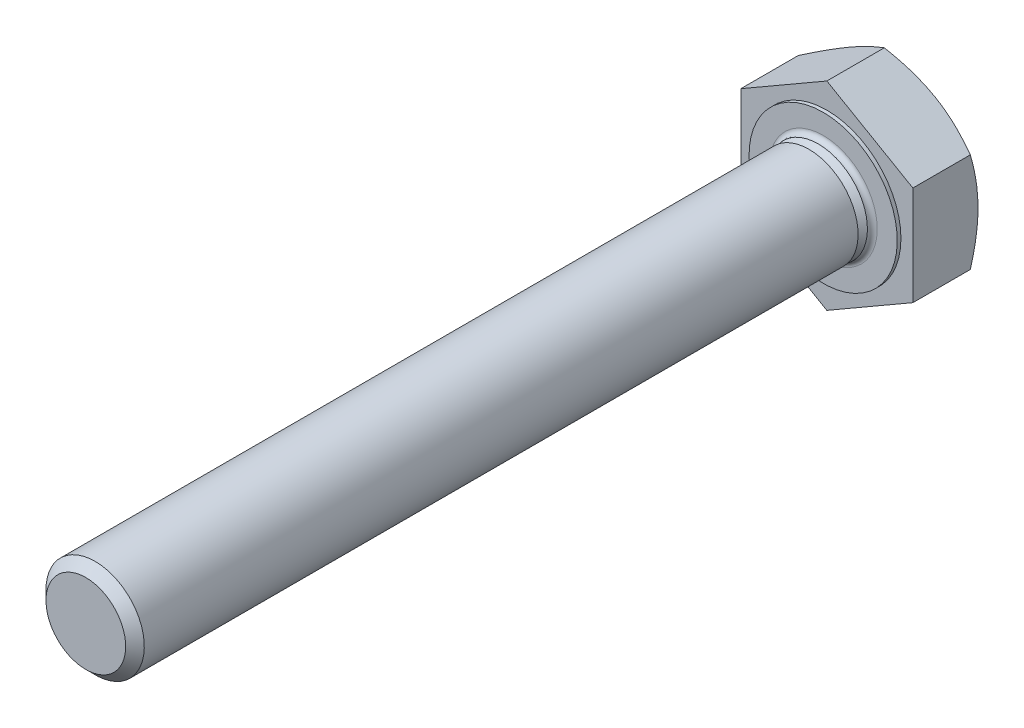
ISO-10303-21;
HEADER;
FILE_DESCRIPTION(('STEP AP214'),'2;1');
FILE_NAME('part.step','',(''),(''),'','','');
FILE_SCHEMA(('AUTOMOTIVE_DESIGN { 1 0 10303 214 1 1 1 1 }'));
ENDSEC;
DATA;
#1=APPLICATION_CONTEXT('core data for automotive mechanical design processes');
#2=APPLICATION_PROTOCOL_DEFINITION('international standard','automotive_design',2000,#1);
#3=PRODUCT_CONTEXT('',#1,'mechanical');
#4=PRODUCT('Part','Part','',(#3));
#5=PRODUCT_RELATED_PRODUCT_CATEGORY('part','',(#4));
#6=PRODUCT_DEFINITION_FORMATION('','',#4);
#7=PRODUCT_DEFINITION_CONTEXT('part definition',#1,'design');
#8=PRODUCT_DEFINITION('design','',#6,#7);
#9=PRODUCT_DEFINITION_SHAPE('','',#8);
#10=(LENGTH_UNIT() NAMED_UNIT(*) SI_UNIT(.MILLI.,.METRE.));
#11=(NAMED_UNIT(*) PLANE_ANGLE_UNIT() SI_UNIT($,.RADIAN.));
#12=(NAMED_UNIT(*) SI_UNIT($,.STERADIAN.) SOLID_ANGLE_UNIT());
#13=UNCERTAINTY_MEASURE_WITH_UNIT(LENGTH_MEASURE(1.E-05),#10,'distance_accuracy_value','');
#14=(GEOMETRIC_REPRESENTATION_CONTEXT(3) GLOBAL_UNCERTAINTY_ASSIGNED_CONTEXT((#13)) GLOBAL_UNIT_ASSIGNED_CONTEXT((#10,
#11,#12)) REPRESENTATION_CONTEXT('',''));
#15=CARTESIAN_POINT('',(0.,0.,0.));
#16=DIRECTION('',(0.,0.,1.));
#17=DIRECTION('',(1.,0.,0.));
#18=AXIS2_PLACEMENT_3D('',#15,#16,#17);
#19=CARTESIAN_POINT('',(0.,0.8105625,30.));
#20=DIRECTION('',(0.,0.,1.));
#21=DIRECTION('',(0.,1.,0.));
#22=AXIS2_PLACEMENT_3D('',#19,#20,#21);
#23=PLANE('',#22);
#24=CARTESIAN_POINT('',(0.,0.,30.));
#25=DIRECTION('',(0.,0.,1.));
#26=DIRECTION('',(0.,1.,0.));
#27=AXIS2_PLACEMENT_3D('',#24,#25,#26);
#28=CIRCLE('',#27,1.621125);
#29=CARTESIAN_POINT('',(0.,1.621125,30.));
#30=VERTEX_POINT('',#29);
#31=EDGE_CURVE('E11',#30,#30,#28,.T.);
#32=ORIENTED_EDGE('',*,*,#31,.T.);
#33=EDGE_LOOP('',(#32));
#34=FACE_BOUND('',#33,.T.);
#35=ADVANCED_FACE('F17',(#34),#23,.T.);
#36=CARTESIAN_POINT('',(0.,0.,29.8105625));
#37=DIRECTION('',(0.,0.,-1.));
#38=DIRECTION('',(0.,1.,0.));
#39=AXIS2_PLACEMENT_3D('',#36,#37,#38);
#40=CONICAL_SURFACE('',#39,1.8105625,0.785398163397448);
#41=CARTESIAN_POINT('',(0.,0.,29.621125));
#42=DIRECTION('',(0.,0.,1.));
#43=DIRECTION('',(0.,1.,0.));
#44=AXIS2_PLACEMENT_3D('',#41,#42,#43);
#45=CIRCLE('',#44,2.);
#46=CARTESIAN_POINT('',(0.,2.,29.621125));
#47=VERTEX_POINT('',#46);
#48=EDGE_CURVE('E26',#47,#47,#45,.T.);
#49=ORIENTED_EDGE('',*,*,#48,.T.);
#50=EDGE_LOOP('',(#49));
#51=FACE_BOUND('',#50,.T.);
#52=ORIENTED_EDGE('',*,*,#31,.F.);
#53=EDGE_LOOP('',(#52));
#54=FACE_BOUND('',#53,.T.);
#55=ADVANCED_FACE('F319',(#51,#54),#40,.T.);
#56=CARTESIAN_POINT('',(0.,0.,15.1));
#57=DIRECTION('',(0.,0.,-1.));
#58=DIRECTION('',(0.,1.,0.));
#59=AXIS2_PLACEMENT_3D('',#56,#57,#58);
#60=CYLINDRICAL_SURFACE('',#59,2.);
#61=CARTESIAN_POINT('',(0.,0.,0.578875));
#62=DIRECTION('',(0.,0.,1.));
#63=DIRECTION('',(0.,1.,0.));
#64=AXIS2_PLACEMENT_3D('',#61,#62,#63);
#65=CIRCLE('',#64,2.);
#66=CARTESIAN_POINT('',(0.,2.,0.578875));
#67=VERTEX_POINT('',#66);
#68=EDGE_CURVE('E165',#67,#67,#65,.T.);
#69=ORIENTED_EDGE('',*,*,#68,.T.);
#70=EDGE_LOOP('',(#69));
#71=FACE_BOUND('',#70,.T.);
#72=ORIENTED_EDGE('',*,*,#48,.F.);
#73=EDGE_LOOP('',(#72));
#74=FACE_BOUND('',#73,.T.);
#75=ADVANCED_FACE('F323',(#71,#74),#60,.T.);
#76=CARTESIAN_POINT('',(0.,1.8105625,0.578875));
#77=DIRECTION('',(0.,0.,-1.));
#78=DIRECTION('',(0.,-1.,0.));
#79=AXIS2_PLACEMENT_3D('',#76,#77,#78);
#80=PLANE('',#79);
#81=CARTESIAN_POINT('',(0.,0.,0.578875));
#82=DIRECTION('',(0.,0.,1.));
#83=DIRECTION('',(0.,1.,0.));
#84=AXIS2_PLACEMENT_3D('',#81,#82,#83);
#85=CIRCLE('',#84,1.621125);
#86=CARTESIAN_POINT('',(0.,1.621125,0.578875));
#87=VERTEX_POINT('',#86);
#88=EDGE_CURVE('E161',#87,#87,#85,.T.);
#89=ORIENTED_EDGE('',*,*,#88,.T.);
#90=EDGE_LOOP('',(#89));
#91=FACE_BOUND('',#90,.T.);
#92=ORIENTED_EDGE('',*,*,#68,.F.);
#93=EDGE_LOOP('',(#92));
#94=FACE_BOUND('',#93,.T.);
#95=ADVANCED_FACE('F329',(#91,#94),#80,.T.);
#96=CARTESIAN_POINT('',(0.,0.,0.3894375));
#97=DIRECTION('',(0.,0.,-1.));
#98=DIRECTION('',(0.,1.,0.));
#99=AXIS2_PLACEMENT_3D('',#96,#97,#98);
#100=CONICAL_SURFACE('',#99,1.8105625,0.785398163397448);
#101=CARTESIAN_POINT('',(0.,0.,0.2));
#102=DIRECTION('',(0.,0.,1.));
#103=DIRECTION('',(0.,1.,0.));
#104=AXIS2_PLACEMENT_3D('',#101,#102,#103);
#105=CIRCLE('',#104,2.);
#106=CARTESIAN_POINT('',(0.,2.,0.2));
#107=VERTEX_POINT('',#106);
#108=EDGE_CURVE('E166',#107,#107,#105,.T.);
#109=ORIENTED_EDGE('',*,*,#108,.T.);
#110=EDGE_LOOP('',(#109));
#111=FACE_BOUND('',#110,.T.);
#112=ORIENTED_EDGE('',*,*,#88,.F.);
#113=EDGE_LOOP('',(#112));
#114=FACE_BOUND('',#113,.T.);
#115=ADVANCED_FACE('F336',(#111,#114),#100,.T.);
#116=CARTESIAN_POINT('',(0.,0.,0.2));
#117=DIRECTION('',(0.,0.,1.));
#118=DIRECTION('',(1.,0.,0.));
#119=AXIS2_PLACEMENT_3D('',#116,#117,#118);
#120=TOROIDAL_SURFACE('',#119,2.2,0.2);
#121=CARTESIAN_POINT('',(0.,0.,0.));
#122=DIRECTION('',(0.,0.,1.));
#123=DIRECTION('',(0.,1.,0.));
#124=AXIS2_PLACEMENT_3D('',#121,#122,#123);
#125=CIRCLE('',#124,2.2);
#126=CARTESIAN_POINT('',(0.,2.2,0.));
#127=VERTEX_POINT('',#126);
#128=EDGE_CURVE('E199',#127,#127,#125,.T.);
#129=ORIENTED_EDGE('',*,*,#128,.T.);
#130=EDGE_LOOP('',(#129));
#131=FACE_BOUND('',#130,.T.);
#132=ORIENTED_EDGE('',*,*,#108,.F.);
#133=EDGE_LOOP('',(#132));
#134=FACE_BOUND('',#133,.T.);
#135=ADVANCED_FACE('F333',(#131,#134),#120,.F.);
#136=CARTESIAN_POINT('',(0.,2.6075,0.));
#137=DIRECTION('',(0.,0.,1.));
#138=DIRECTION('',(0.,1.,0.));
#139=AXIS2_PLACEMENT_3D('',#136,#137,#138);
#140=PLANE('',#139);
#141=CARTESIAN_POINT('',(0.,0.,0.));
#142=DIRECTION('',(0.,0.,1.));
#143=DIRECTION('',(0.,1.,0.));
#144=AXIS2_PLACEMENT_3D('',#141,#142,#143);
#145=CIRCLE('',#144,3.015);
#146=CARTESIAN_POINT('',(0.,3.015,0.));
#147=VERTEX_POINT('',#146);
#148=EDGE_CURVE('E198',#147,#147,#145,.T.);
#149=ORIENTED_EDGE('',*,*,#148,.T.);
#150=EDGE_LOOP('',(#149));
#151=FACE_BOUND('',#150,.T.);
#152=ORIENTED_EDGE('',*,*,#128,.F.);
#153=EDGE_LOOP('',(#152));
#154=FACE_BOUND('',#153,.T.);
#155=ADVANCED_FACE('F335',(#151,#154),#140,.T.);
#156=CARTESIAN_POINT('',(0.,0.,-0.325));
#157=DIRECTION('',(0.,0.,-1.));
#158=DIRECTION('',(0.,1.,0.));
#159=AXIS2_PLACEMENT_3D('',#156,#157,#158);
#160=CYLINDRICAL_SURFACE('',#159,3.015);
#161=ORIENTED_EDGE('',*,*,#148,.F.);
#162=EDGE_LOOP('',(#161));
#163=FACE_BOUND('',#162,.T.);
#164=CARTESIAN_POINT('',(0.,0.,-0.15));
#165=DIRECTION('',(0.,0.,1.));
#166=DIRECTION('',(0.,1.,0.));
#167=AXIS2_PLACEMENT_3D('',#164,#165,#166);
#168=CIRCLE('',#167,3.015);
#169=CARTESIAN_POINT('',(0.,-3.015,-0.15));
#170=VERTEX_POINT('',#169);
#171=EDGE_CURVE('E182',#170,#170,#168,.T.);
#172=ORIENTED_EDGE('',*,*,#171,.T.);
#173=EDGE_LOOP('',(#172));
#174=FACE_BOUND('',#173,.T.);
#175=ADVANCED_FACE('F338',(#163,#174),#160,.T.);
#176=CARTESIAN_POINT('',(-1.75,-3.03108891324554,0.85));
#177=DIRECTION('',(-0.5,-0.866025403784439,0.));
#178=DIRECTION('',(-0.866025403784439,0.5,0.));
#179=AXIS2_PLACEMENT_3D('',#176,#177,#178);
#180=PLANE('',#179);
#181=CARTESIAN_POINT('',(0.00181468412044161,-4.04249959269281,-2.48678747896463));
#182=CARTESIAN_POINT('',(-0.937092954004441,-3.50042101507722,-2.8));
#183=CARTESIAN_POINT('',(-1.75,-3.03108891324554,-2.8));
#184=CARTESIAN_POINT('',(-2.56290704599556,-2.56175681141386,-2.8));
#185=CARTESIAN_POINT('',(-3.50181468412044,-2.01967823379826,-2.48678747896463));
#186=(BOUNDED_CURVE() B_SPLINE_CURVE(2,(#181,#182,#183,#184,#185),.UNSPECIFIED.,.F.,
.F.) B_SPLINE_CURVE_WITH_KNOTS((3,2,3),(0.,2.05216073912997,4.10432147825994),
.UNSPECIFIED.) CURVE() GEOMETRIC_REPRESENTATION_ITEM() RATIONAL_B_SPLINE_CURVE((1.,
1.03802697460134,1.,1.03802697460134,1.)) REPRESENTATION_ITEM(''));
#187=CARTESIAN_POINT('',(0.,-4.04145188432738,-2.48739260883036));
#188=VERTEX_POINT('',#187);
#189=CARTESIAN_POINT('',(-1.75,-3.03108891324554,-2.8));
#190=VERTEX_POINT('',#189);
#191=EDGE_CURVE('E122',#188,#190,#186,.T.);
#192=ORIENTED_EDGE('',*,*,#191,.F.);
#193=DIRECTION('',(0.,0.,-1.));
#194=VECTOR('',#193,1.);
#195=CARTESIAN_POINT('',(0.,-4.04145188432738,0.85));
#196=LINE('',#195,#194);
#197=CARTESIAN_POINT('',(0.,-4.04145188432738,-0.15));
#198=VERTEX_POINT('',#197);
#199=EDGE_CURVE('E200',#198,#188,#196,.T.);
#200=ORIENTED_EDGE('',*,*,#199,.F.);
#201=DIRECTION('',(0.866025403784439,-0.5,0.));
#202=VECTOR('',#201,1.);
#203=CARTESIAN_POINT('',(-1.31238653815018,-3.28374516324554,-0.15));
#204=LINE('',#203,#202);
#205=CARTESIAN_POINT('',(-3.5,-2.02072594216369,-0.15));
#206=VERTEX_POINT('',#205);
#207=EDGE_CURVE('E220',#206,#198,#204,.T.);
#208=ORIENTED_EDGE('',*,*,#207,.F.);
#209=DIRECTION('',(0.,0.,-1.));
#210=VECTOR('',#209,1.);
#211=CARTESIAN_POINT('',(-3.5,-2.02072594216369,0.85));
#212=LINE('',#211,#210);
#213=CARTESIAN_POINT('',(-3.5,-2.02072594216369,-2.48739260883036));
#214=VERTEX_POINT('',#213);
#215=EDGE_CURVE('E125',#206,#214,#212,.T.);
#216=ORIENTED_EDGE('',*,*,#215,.T.);
#217=CARTESIAN_POINT('',(0.00181468412044161,-4.04249959269281,-2.48678747896463));
#218=CARTESIAN_POINT('',(-0.937092954004441,-3.50042101507722,-2.8));
#219=CARTESIAN_POINT('',(-1.75,-3.03108891324554,-2.8));
#220=CARTESIAN_POINT('',(-2.56290704599556,-2.56175681141386,-2.8));
#221=CARTESIAN_POINT('',(-3.50181468412044,-2.01967823379826,-2.48678747896463));
#222=(BOUNDED_CURVE() B_SPLINE_CURVE(2,(#217,#218,#219,#220,#221),.UNSPECIFIED.,.F.,
.F.) B_SPLINE_CURVE_WITH_KNOTS((3,2,3),(0.,2.05216073912997,4.10432147825994),
.UNSPECIFIED.) CURVE() GEOMETRIC_REPRESENTATION_ITEM() RATIONAL_B_SPLINE_CURVE((1.,
1.03802697460134,1.,1.03802697460134,1.)) REPRESENTATION_ITEM(''));
#223=EDGE_CURVE('E108',#190,#214,#222,.T.);
#224=ORIENTED_EDGE('',*,*,#223,.F.);
#225=EDGE_LOOP('',(#192,#200,#208,#216,#224));
#226=FACE_BOUND('',#225,.T.);
#227=ADVANCED_FACE('F119',(#226),#180,.T.);
#228=CARTESIAN_POINT('',(3.5,0.,0.85));
#229=DIRECTION('',(1.,0.,0.));
#230=DIRECTION('',(0.,-1.,0.));
#231=AXIS2_PLACEMENT_3D('',#228,#229,#230);
#232=PLANE('',#231);
#233=CARTESIAN_POINT('',(3.5,2.02282135889455,-2.48678747896463));
#234=CARTESIAN_POINT('',(3.5,0.938664203663368,-2.8));
#235=CARTESIAN_POINT('',(3.5,0.,-2.8));
#236=CARTESIAN_POINT('',(3.5,-0.938664203663366,-2.8));
#237=CARTESIAN_POINT('',(3.5,-2.02282135889455,-2.48678747896463));
#238=(BOUNDED_CURVE() B_SPLINE_CURVE(2,(#233,#234,#235,#236,#237),.UNSPECIFIED.,.F.,
.F.) B_SPLINE_CURVE_WITH_KNOTS((3,2,3),(0.,2.05216073912997,4.10432147825995),
.UNSPECIFIED.) CURVE() GEOMETRIC_REPRESENTATION_ITEM() RATIONAL_B_SPLINE_CURVE((1.,
1.03802697460135,1.,1.03802697460134,1.)) REPRESENTATION_ITEM(''));
#239=CARTESIAN_POINT('',(3.5,2.02072594216369,-2.48739260883035));
#240=VERTEX_POINT('',#239);
#241=CARTESIAN_POINT('',(3.5,0.,-2.8));
#242=VERTEX_POINT('',#241);
#243=EDGE_CURVE('E160',#240,#242,#238,.T.);
#244=ORIENTED_EDGE('',*,*,#243,.F.);
#245=DIRECTION('',(0.,0.,-1.));
#246=VECTOR('',#245,1.);
#247=CARTESIAN_POINT('',(3.5,2.02072594216369,0.85));
#248=LINE('',#247,#246);
#249=CARTESIAN_POINT('',(3.5,2.02072594216369,-0.15));
#250=VERTEX_POINT('',#249);
#251=EDGE_CURVE('E197',#250,#240,#248,.T.);
#252=ORIENTED_EDGE('',*,*,#251,.F.);
#253=DIRECTION('',(0.,1.,0.));
#254=VECTOR('',#253,1.);
#255=CARTESIAN_POINT('',(3.5,-1.010625,-0.15));
#256=LINE('',#255,#254);
#257=CARTESIAN_POINT('',(3.5,-2.02072594216369,-0.15));
#258=VERTEX_POINT('',#257);
#259=EDGE_CURVE('E233',#258,#250,#256,.T.);
#260=ORIENTED_EDGE('',*,*,#259,.F.);
#261=DIRECTION('',(0.,0.,-1.));
#262=VECTOR('',#261,1.);
#263=CARTESIAN_POINT('',(3.5,-2.02072594216369,0.85));
#264=LINE('',#263,#262);
#265=CARTESIAN_POINT('',(3.5,-2.02072594216369,-2.48739260883035));
#266=VERTEX_POINT('',#265);
#267=EDGE_CURVE('E196',#258,#266,#264,.T.);
#268=ORIENTED_EDGE('',*,*,#267,.T.);
#269=CARTESIAN_POINT('',(3.5,2.02282135889455,-2.48678747896463));
#270=CARTESIAN_POINT('',(3.5,0.938664203663368,-2.8));
#271=CARTESIAN_POINT('',(3.5,0.,-2.8));
#272=CARTESIAN_POINT('',(3.5,-0.938664203663366,-2.8));
#273=CARTESIAN_POINT('',(3.5,-2.02282135889455,-2.48678747896463));
#274=(BOUNDED_CURVE() B_SPLINE_CURVE(2,(#269,#270,#271,#272,#273),.UNSPECIFIED.,.F.,
.F.) B_SPLINE_CURVE_WITH_KNOTS((3,2,3),(0.,2.05216073912997,4.10432147825995),
.UNSPECIFIED.) CURVE() GEOMETRIC_REPRESENTATION_ITEM() RATIONAL_B_SPLINE_CURVE((1.,
1.03802697460135,1.,1.03802697460134,1.)) REPRESENTATION_ITEM(''));
#275=EDGE_CURVE('E238',#242,#266,#274,.T.);
#276=ORIENTED_EDGE('',*,*,#275,.F.);
#277=EDGE_LOOP('',(#244,#252,#260,#268,#276));
#278=FACE_BOUND('',#277,.T.);
#279=ADVANCED_FACE('F303',(#278),#232,.T.);
#280=CARTESIAN_POINT('',(1.75,-3.03108891324554,0.85));
#281=DIRECTION('',(0.5,-0.866025403784439,0.));
#282=DIRECTION('',(-0.866025403784439,-0.5,0.));
#283=AXIS2_PLACEMENT_3D('',#280,#281,#282);
#284=PLANE('',#283);
#285=CARTESIAN_POINT('',(3.50181468412044,-2.01967823379826,-2.48678747896463));
#286=CARTESIAN_POINT('',(2.56290704599557,-2.56175681141385,-2.8));
#287=CARTESIAN_POINT('',(1.75,-3.03108891324554,-2.8));
#288=CARTESIAN_POINT('',(0.937092954004435,-3.50042101507722,-2.8));
#289=CARTESIAN_POINT('',(-0.00181468412044134,-4.04249959269281,-2.48678747896463));
#290=(BOUNDED_CURVE() B_SPLINE_CURVE(2,(#285,#286,#287,#288,#289),.UNSPECIFIED.,.F.,
.F.) B_SPLINE_CURVE_WITH_KNOTS((3,2,3),(0.,2.05216073912997,4.10432147825994),
.UNSPECIFIED.) CURVE() GEOMETRIC_REPRESENTATION_ITEM() RATIONAL_B_SPLINE_CURVE((1.,
1.03802697460134,1.,1.03802697460135,1.)) REPRESENTATION_ITEM(''));
#291=CARTESIAN_POINT('',(1.75,-3.03108891324554,-2.8));
#292=VERTEX_POINT('',#291);
#293=EDGE_CURVE('E243',#266,#292,#290,.T.);
#294=ORIENTED_EDGE('',*,*,#293,.F.);
#295=ORIENTED_EDGE('',*,*,#267,.F.);
#296=DIRECTION('',(0.866025403784439,0.5,0.));
#297=VECTOR('',#296,1.);
#298=CARTESIAN_POINT('',(1.31238653815018,-3.28374516324554,-0.15));
#299=LINE('',#298,#297);
#300=EDGE_CURVE('E144',#198,#258,#299,.T.);
#301=ORIENTED_EDGE('',*,*,#300,.F.);
#302=ORIENTED_EDGE('',*,*,#199,.T.);
#303=CARTESIAN_POINT('',(3.50181468412044,-2.01967823379826,-2.48678747896463));
#304=CARTESIAN_POINT('',(2.56290704599557,-2.56175681141385,-2.8));
#305=CARTESIAN_POINT('',(1.75,-3.03108891324554,-2.8));
#306=CARTESIAN_POINT('',(0.937092954004435,-3.50042101507722,-2.8));
#307=CARTESIAN_POINT('',(-0.00181468412044134,-4.04249959269281,-2.48678747896463));
#308=(BOUNDED_CURVE() B_SPLINE_CURVE(2,(#303,#304,#305,#306,#307),.UNSPECIFIED.,.F.,
.F.) B_SPLINE_CURVE_WITH_KNOTS((3,2,3),(0.,2.05216073912997,4.10432147825994),
.UNSPECIFIED.) CURVE() GEOMETRIC_REPRESENTATION_ITEM() RATIONAL_B_SPLINE_CURVE((1.,
1.03802697460134,1.,1.03802697460135,1.)) REPRESENTATION_ITEM(''));
#309=EDGE_CURVE('E137',#292,#188,#308,.T.);
#310=ORIENTED_EDGE('',*,*,#309,.F.);
#311=EDGE_LOOP('',(#294,#295,#301,#302,#310));
#312=FACE_BOUND('',#311,.T.);
#313=ADVANCED_FACE('F299',(#312),#284,.T.);
#314=CARTESIAN_POINT('',(-3.5,0.,0.85));
#315=DIRECTION('',(-1.,0.,0.));
#316=DIRECTION('',(0.,1.,0.));
#317=AXIS2_PLACEMENT_3D('',#314,#315,#316);
#318=PLANE('',#317);
#319=CARTESIAN_POINT('',(-3.5,-2.02282135889455,-2.48678747896463));
#320=CARTESIAN_POINT('',(-3.5,-0.938664203663363,-2.8));
#321=CARTESIAN_POINT('',(-3.5,0.,-2.8));
#322=CARTESIAN_POINT('',(-3.5,0.938664203663364,-2.8));
#323=CARTESIAN_POINT('',(-3.5,2.02282135889455,-2.48678747896463));
#324=(BOUNDED_CURVE() B_SPLINE_CURVE(2,(#319,#320,#321,#322,#323),.UNSPECIFIED.,.F.,
.F.) B_SPLINE_CURVE_WITH_KNOTS((3,2,3),(0.,2.05216073912997,4.10432147825994),
.UNSPECIFIED.) CURVE() GEOMETRIC_REPRESENTATION_ITEM() RATIONAL_B_SPLINE_CURVE((1.,
1.03802697460134,1.,1.03802697460134,1.)) REPRESENTATION_ITEM(''));
#325=CARTESIAN_POINT('',(-3.5,0.,-2.8));
#326=VERTEX_POINT('',#325);
#327=CARTESIAN_POINT('',(-3.5,2.02072594216369,-2.48739260883036));
#328=VERTEX_POINT('',#327);
#329=EDGE_CURVE('E191',#326,#328,#324,.T.);
#330=ORIENTED_EDGE('',*,*,#329,.F.);
#331=CARTESIAN_POINT('',(-3.5,-2.02282135889455,-2.48678747896463));
#332=CARTESIAN_POINT('',(-3.5,-0.938664203663363,-2.8));
#333=CARTESIAN_POINT('',(-3.5,0.,-2.8));
#334=CARTESIAN_POINT('',(-3.5,0.938664203663364,-2.8));
#335=CARTESIAN_POINT('',(-3.5,2.02282135889455,-2.48678747896463));
#336=(BOUNDED_CURVE() B_SPLINE_CURVE(2,(#331,#332,#333,#334,#335),.UNSPECIFIED.,.F.,
.F.) B_SPLINE_CURVE_WITH_KNOTS((3,2,3),(0.,2.05216073912997,4.10432147825994),
.UNSPECIFIED.) CURVE() GEOMETRIC_REPRESENTATION_ITEM() RATIONAL_B_SPLINE_CURVE((1.,
1.03802697460134,1.,1.03802697460134,1.)) REPRESENTATION_ITEM(''));
#337=EDGE_CURVE('E110',#214,#326,#336,.T.);
#338=ORIENTED_EDGE('',*,*,#337,.F.);
#339=ORIENTED_EDGE('',*,*,#215,.F.);
#340=DIRECTION('',(0.,-1.,0.));
#341=VECTOR('',#340,1.);
#342=CARTESIAN_POINT('',(-3.5,-1.010625,-0.15));
#343=LINE('',#342,#341);
#344=CARTESIAN_POINT('',(-3.5,2.02072594216369,-0.15));
#345=VERTEX_POINT('',#344);
#346=EDGE_CURVE('E174',#345,#206,#343,.T.);
#347=ORIENTED_EDGE('',*,*,#346,.F.);
#348=DIRECTION('',(0.,0.,-1.));
#349=VECTOR('',#348,1.);
#350=CARTESIAN_POINT('',(-3.5,2.02072594216369,0.85));
#351=LINE('',#350,#349);
#352=EDGE_CURVE('E115',#345,#328,#351,.T.);
#353=ORIENTED_EDGE('',*,*,#352,.T.);
#354=EDGE_LOOP('',(#330,#338,#339,#347,#353));
#355=FACE_BOUND('',#354,.T.);
#356=ADVANCED_FACE('F296',(#355),#318,.T.);
#357=CARTESIAN_POINT('',(1.75,3.03108891324554,0.85));
#358=DIRECTION('',(0.5,0.866025403784439,0.));
#359=DIRECTION('',(0.866025403784439,-0.5,0.));
#360=AXIS2_PLACEMENT_3D('',#357,#358,#359);
#361=PLANE('',#360);
#362=CARTESIAN_POINT('',(-0.00181468412044277,4.04249959269281,-2.48678747896463));
#363=CARTESIAN_POINT('',(0.937092954004438,3.50042101507722,-2.8));
#364=CARTESIAN_POINT('',(1.75,3.03108891324554,-2.8));
#365=CARTESIAN_POINT('',(2.56290704599556,2.56175681141385,-2.8));
#366=CARTESIAN_POINT('',(3.50181468412044,2.01967823379826,-2.48678747896463));
#367=(BOUNDED_CURVE() B_SPLINE_CURVE(2,(#362,#363,#364,#365,#366),.UNSPECIFIED.,.F.,
.F.) B_SPLINE_CURVE_WITH_KNOTS((3,2,3),(0.,2.05216073912997,4.10432147825994),
.UNSPECIFIED.) CURVE() GEOMETRIC_REPRESENTATION_ITEM() RATIONAL_B_SPLINE_CURVE((1.,
1.03802697460135,1.,1.03802697460134,1.)) REPRESENTATION_ITEM(''));
#368=CARTESIAN_POINT('',(1.75,3.03108891324554,-2.8));
#369=VERTEX_POINT('',#368);
#370=EDGE_CURVE('E219',#369,#240,#367,.T.);
#371=ORIENTED_EDGE('',*,*,#370,.F.);
#372=CARTESIAN_POINT('',(-0.00181468412044277,4.04249959269281,-2.48678747896463));
#373=CARTESIAN_POINT('',(0.937092954004438,3.50042101507722,-2.8));
#374=CARTESIAN_POINT('',(1.75,3.03108891324554,-2.8));
#375=CARTESIAN_POINT('',(2.56290704599556,2.56175681141385,-2.8));
#376=CARTESIAN_POINT('',(3.50181468412044,2.01967823379826,-2.48678747896463));
#377=(BOUNDED_CURVE() B_SPLINE_CURVE(2,(#372,#373,#374,#375,#376),.UNSPECIFIED.,.F.,
.F.) B_SPLINE_CURVE_WITH_KNOTS((3,2,3),(0.,2.05216073912997,4.10432147825994),
.UNSPECIFIED.) CURVE() GEOMETRIC_REPRESENTATION_ITEM() RATIONAL_B_SPLINE_CURVE((1.,
1.03802697460135,1.,1.03802697460134,1.)) REPRESENTATION_ITEM(''));
#378=CARTESIAN_POINT('',(0.,4.04145188432738,-2.48739260883035));
#379=VERTEX_POINT('',#378);
#380=EDGE_CURVE('E183',#379,#369,#377,.T.);
#381=ORIENTED_EDGE('',*,*,#380,.F.);
#382=DIRECTION('',(0.,0.,-1.));
#383=VECTOR('',#382,1.);
#384=CARTESIAN_POINT('',(0.,4.04145188432738,0.85));
#385=LINE('',#384,#383);
#386=CARTESIAN_POINT('',(0.,4.04145188432738,-0.15));
#387=VERTEX_POINT('',#386);
#388=EDGE_CURVE('E208',#387,#379,#385,.T.);
#389=ORIENTED_EDGE('',*,*,#388,.F.);
#390=DIRECTION('',(-0.866025403784439,0.5,0.));
#391=VECTOR('',#390,1.);
#392=CARTESIAN_POINT('',(2.18761346184982,2.77843266324553,-0.15));
#393=LINE('',#392,#391);
#394=EDGE_CURVE('E230',#250,#387,#393,.T.);
#395=ORIENTED_EDGE('',*,*,#394,.F.);
#396=ORIENTED_EDGE('',*,*,#251,.T.);
#397=EDGE_LOOP('',(#371,#381,#389,#395,#396));
#398=FACE_BOUND('',#397,.T.);
#399=ADVANCED_FACE('F287',(#398),#361,.T.);
#400=CARTESIAN_POINT('',(-1.75,3.03108891324554,0.85));
#401=DIRECTION('',(-0.5,0.866025403784439,0.));
#402=DIRECTION('',(0.866025403784439,0.5,0.));
#403=AXIS2_PLACEMENT_3D('',#400,#401,#402);
#404=PLANE('',#403);
#405=CARTESIAN_POINT('',(-3.50181468412044,2.01967823379826,-2.48678747896463));
#406=CARTESIAN_POINT('',(-2.56290704599557,2.56175681141386,-2.8));
#407=CARTESIAN_POINT('',(-1.75,3.03108891324554,-2.8));
#408=CARTESIAN_POINT('',(-0.937092954004439,3.50042101507722,-2.8));
#409=CARTESIAN_POINT('',(0.00181468412044018,4.04249959269281,-2.48678747896463));
#410=(BOUNDED_CURVE() B_SPLINE_CURVE(2,(#405,#406,#407,#408,#409),.UNSPECIFIED.,.F.,
.F.) B_SPLINE_CURVE_WITH_KNOTS((3,2,3),(0.,2.05216073912997,4.10432147825994),
.UNSPECIFIED.) CURVE() GEOMETRIC_REPRESENTATION_ITEM() RATIONAL_B_SPLINE_CURVE((1.,
1.03802697460134,1.,1.03802697460134,1.)) REPRESENTATION_ITEM(''));
#411=CARTESIAN_POINT('',(-1.75,3.03108891324554,-2.8));
#412=VERTEX_POINT('',#411);
#413=EDGE_CURVE('E152',#412,#379,#410,.T.);
#414=ORIENTED_EDGE('',*,*,#413,.F.);
#415=CARTESIAN_POINT('',(-3.50181468412044,2.01967823379826,-2.48678747896463));
#416=CARTESIAN_POINT('',(-2.56290704599557,2.56175681141386,-2.8));
#417=CARTESIAN_POINT('',(-1.75,3.03108891324554,-2.8));
#418=CARTESIAN_POINT('',(-0.937092954004439,3.50042101507722,-2.8));
#419=CARTESIAN_POINT('',(0.00181468412044018,4.04249959269281,-2.48678747896463));
#420=(BOUNDED_CURVE() B_SPLINE_CURVE(2,(#415,#416,#417,#418,#419),.UNSPECIFIED.,.F.,
.F.) B_SPLINE_CURVE_WITH_KNOTS((3,2,3),(0.,2.05216073912997,4.10432147825994),
.UNSPECIFIED.) CURVE() GEOMETRIC_REPRESENTATION_ITEM() RATIONAL_B_SPLINE_CURVE((1.,
1.03802697460134,1.,1.03802697460134,1.)) REPRESENTATION_ITEM(''));
#421=EDGE_CURVE('E176',#328,#412,#420,.T.);
#422=ORIENTED_EDGE('',*,*,#421,.F.);
#423=ORIENTED_EDGE('',*,*,#352,.F.);
#424=DIRECTION('',(-0.866025403784439,-0.5,0.));
#425=VECTOR('',#424,1.);
#426=CARTESIAN_POINT('',(-2.18761346184982,2.77843266324553,-0.15));
#427=LINE('',#426,#425);
#428=EDGE_CURVE('E227',#387,#345,#427,.T.);
#429=ORIENTED_EDGE('',*,*,#428,.F.);
#430=ORIENTED_EDGE('',*,*,#388,.T.);
#431=EDGE_LOOP('',(#414,#422,#423,#429,#430));
#432=FACE_BOUND('',#431,.T.);
#433=ADVANCED_FACE('F278',(#432),#404,.T.);
#434=CARTESIAN_POINT('',(0.,-1.75,-2.8));
#435=DIRECTION('',(0.,0.,-1.));
#436=DIRECTION('',(0.,-1.,0.));
#437=AXIS2_PLACEMENT_3D('',#434,#435,#436);
#438=PLANE('',#437);
#439=CARTESIAN_POINT('',(0.,0.,-2.8));
#440=DIRECTION('',(0.,0.,-1.));
#441=DIRECTION('',(0.,-1.,0.));
#442=AXIS2_PLACEMENT_3D('',#439,#440,#441);
#443=CIRCLE('',#442,3.5);
#444=EDGE_CURVE('E126',#292,#190,#443,.T.);
#445=ORIENTED_EDGE('',*,*,#444,.T.);
#446=CARTESIAN_POINT('',(0.,0.,-2.8));
#447=DIRECTION('',(0.,0.,-1.));
#448=DIRECTION('',(0.,-1.,0.));
#449=AXIS2_PLACEMENT_3D('',#446,#447,#448);
#450=CIRCLE('',#449,3.5);
#451=EDGE_CURVE('E105',#190,#326,#450,.T.);
#452=ORIENTED_EDGE('',*,*,#451,.T.);
#453=CARTESIAN_POINT('',(0.,0.,-2.8));
#454=DIRECTION('',(0.,0.,-1.));
#455=DIRECTION('',(0.,-1.,0.));
#456=AXIS2_PLACEMENT_3D('',#453,#454,#455);
#457=CIRCLE('',#456,3.5);
#458=EDGE_CURVE('E181',#326,#412,#457,.T.);
#459=ORIENTED_EDGE('',*,*,#458,.T.);
#460=CARTESIAN_POINT('',(0.,0.,-2.8));
#461=DIRECTION('',(0.,0.,-1.));
#462=DIRECTION('',(0.,-1.,0.));
#463=AXIS2_PLACEMENT_3D('',#460,#461,#462);
#464=CIRCLE('',#463,3.5);
#465=EDGE_CURVE('E20',#412,#369,#464,.T.);
#466=ORIENTED_EDGE('',*,*,#465,.T.);
#467=CARTESIAN_POINT('',(0.,0.,-2.8));
#468=DIRECTION('',(0.,0.,-1.));
#469=DIRECTION('',(0.,-1.,0.));
#470=AXIS2_PLACEMENT_3D('',#467,#468,#469);
#471=CIRCLE('',#470,3.5);
#472=EDGE_CURVE('E215',#369,#242,#471,.T.);
#473=ORIENTED_EDGE('',*,*,#472,.T.);
#474=CARTESIAN_POINT('',(0.,0.,-2.8));
#475=DIRECTION('',(0.,0.,-1.));
#476=DIRECTION('',(0.,-1.,0.));
#477=AXIS2_PLACEMENT_3D('',#474,#475,#476);
#478=CIRCLE('',#477,3.5);
#479=EDGE_CURVE('E131',#242,#292,#478,.T.);
#480=ORIENTED_EDGE('',*,*,#479,.T.);
#481=EDGE_LOOP('',(#445,#452,#459,#466,#473,#480));
#482=FACE_BOUND('',#481,.T.);
#483=ADVANCED_FACE('F129',(#482),#438,.T.);
#484=CARTESIAN_POINT('',(0.,0.,-2.64339373948232));
#485=DIRECTION('',(0.,0.,1.));
#486=DIRECTION('',(0.,-1.,0.));
#487=AXIS2_PLACEMENT_3D('',#484,#485,#486);
#488=CONICAL_SURFACE('',#487,3.77125,1.0471975511966);
#489=ORIENTED_EDGE('',*,*,#223,.T.);
#490=ORIENTED_EDGE('',*,*,#337,.T.);
#491=ORIENTED_EDGE('',*,*,#451,.F.);
#492=EDGE_LOOP('',(#489,#490,#491));
#493=FACE_BOUND('',#492,.T.);
#494=ADVANCED_FACE('F107',(#493),#488,.T.);
#495=CARTESIAN_POINT('',(0.,0.,-2.64339373948232));
#496=DIRECTION('',(0.,0.,1.));
#497=DIRECTION('',(0.,-1.,0.));
#498=AXIS2_PLACEMENT_3D('',#495,#496,#497);
#499=CONICAL_SURFACE('',#498,3.77125,1.0471975511966);
#500=ORIENTED_EDGE('',*,*,#309,.T.);
#501=ORIENTED_EDGE('',*,*,#191,.T.);
#502=ORIENTED_EDGE('',*,*,#444,.F.);
#503=EDGE_LOOP('',(#500,#501,#502));
#504=FACE_BOUND('',#503,.T.);
#505=ADVANCED_FACE('F136',(#504),#499,.T.);
#506=CARTESIAN_POINT('',(0.,0.,-2.64339373948232));
#507=DIRECTION('',(0.,0.,1.));
#508=DIRECTION('',(0.,-1.,0.));
#509=AXIS2_PLACEMENT_3D('',#506,#507,#508);
#510=CONICAL_SURFACE('',#509,3.77125,1.0471975511966);
#511=ORIENTED_EDGE('',*,*,#275,.T.);
#512=ORIENTED_EDGE('',*,*,#293,.T.);
#513=ORIENTED_EDGE('',*,*,#479,.F.);
#514=EDGE_LOOP('',(#511,#512,#513));
#515=FACE_BOUND('',#514,.T.);
#516=ADVANCED_FACE('F306',(#515),#510,.T.);
#517=CARTESIAN_POINT('',(0.,0.,-2.64339373948232));
#518=DIRECTION('',(0.,0.,1.));
#519=DIRECTION('',(0.,-1.,0.));
#520=AXIS2_PLACEMENT_3D('',#517,#518,#519);
#521=CONICAL_SURFACE('',#520,3.77125,1.0471975511966);
#522=ORIENTED_EDGE('',*,*,#243,.T.);
#523=ORIENTED_EDGE('',*,*,#472,.F.);
#524=ORIENTED_EDGE('',*,*,#370,.T.);
#525=EDGE_LOOP('',(#522,#523,#524));
#526=FACE_BOUND('',#525,.T.);
#527=ADVANCED_FACE('F291',(#526),#521,.T.);
#528=CARTESIAN_POINT('',(0.,0.,-2.64339373948232));
#529=DIRECTION('',(0.,0.,1.));
#530=DIRECTION('',(0.,-1.,0.));
#531=AXIS2_PLACEMENT_3D('',#528,#529,#530);
#532=CONICAL_SURFACE('',#531,3.77125,1.0471975511966);
#533=ORIENTED_EDGE('',*,*,#380,.T.);
#534=ORIENTED_EDGE('',*,*,#465,.F.);
#535=ORIENTED_EDGE('',*,*,#413,.T.);
#536=EDGE_LOOP('',(#533,#534,#535));
#537=FACE_BOUND('',#536,.T.);
#538=ADVANCED_FACE('F285',(#537),#532,.T.);
#539=CARTESIAN_POINT('',(0.,0.,-2.64339373948232));
#540=DIRECTION('',(0.,0.,1.));
#541=DIRECTION('',(0.,-1.,0.));
#542=AXIS2_PLACEMENT_3D('',#539,#540,#541);
#543=CONICAL_SURFACE('',#542,3.77125,1.0471975511966);
#544=ORIENTED_EDGE('',*,*,#421,.T.);
#545=ORIENTED_EDGE('',*,*,#458,.F.);
#546=ORIENTED_EDGE('',*,*,#329,.T.);
#547=EDGE_LOOP('',(#544,#545,#546));
#548=FACE_BOUND('',#547,.T.);
#549=ADVANCED_FACE('F294',(#548),#543,.T.);
#550=CARTESIAN_POINT('',(0.,-2.02125,-0.15));
#551=DIRECTION('',(0.,0.,1.));
#552=DIRECTION('',(0.,1.,0.));
#553=AXIS2_PLACEMENT_3D('',#550,#551,#552);
#554=PLANE('',#553);
#555=ORIENTED_EDGE('',*,*,#171,.F.);
#556=EDGE_LOOP('',(#555));
#557=FACE_BOUND('',#556,.T.);
#558=ORIENTED_EDGE('',*,*,#300,.T.);
#559=ORIENTED_EDGE('',*,*,#259,.T.);
#560=ORIENTED_EDGE('',*,*,#394,.T.);
#561=ORIENTED_EDGE('',*,*,#428,.T.);
#562=ORIENTED_EDGE('',*,*,#346,.T.);
#563=ORIENTED_EDGE('',*,*,#207,.T.);
#564=EDGE_LOOP('',(#558,#559,#560,#561,#562,#563));
#565=FACE_BOUND('',#564,.T.);
#566=ADVANCED_FACE('F301',(#557,#565),#554,.T.);
#567=CLOSED_SHELL('',(#35,#55,#75,#95,#115,#135,#155,#175,#227,#279,#313,#356,#399,#433,#483,
#494,#505,#516,#527,#538,#549,#566));
#568=MANIFOLD_SOLID_BREP('B1',#567);
#569=ADVANCED_BREP_SHAPE_REPRESENTATION('',(#18,#568),#14);
#570=SHAPE_DEFINITION_REPRESENTATION(#9,#569);
ENDSEC;
END-ISO-10303-21;
